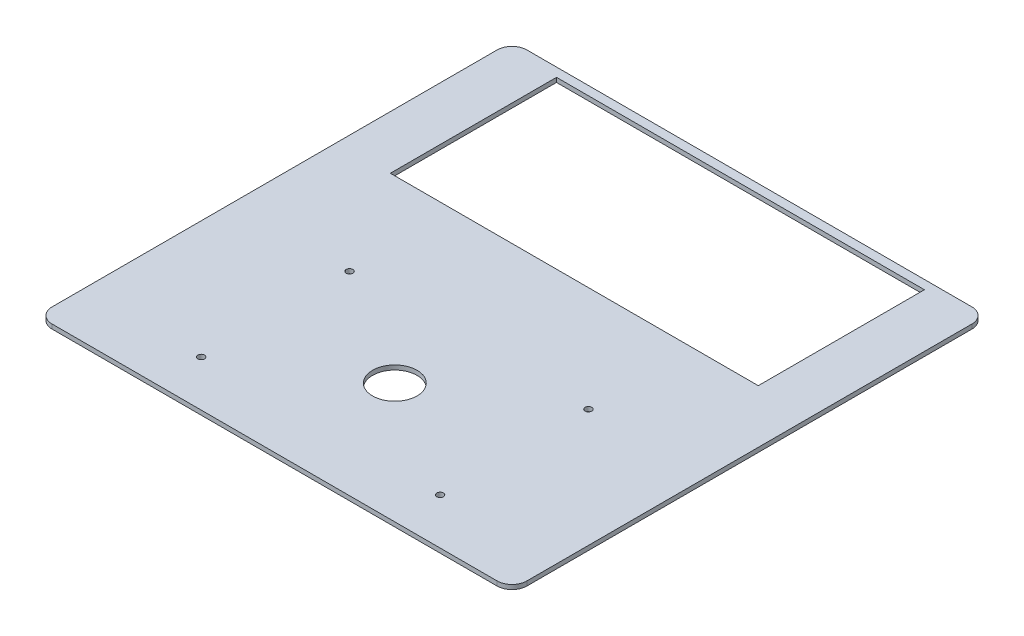
ISO-10303-21;
HEADER;
FILE_DESCRIPTION(('STEP AP214'),'2;1');
FILE_NAME('part.step','',(''),(''),'','','');
FILE_SCHEMA(('AUTOMOTIVE_DESIGN { 1 0 10303 214 1 1 1 1 }'));
ENDSEC;
DATA;
#1=APPLICATION_CONTEXT('core data for automotive mechanical design processes');
#2=APPLICATION_PROTOCOL_DEFINITION('international standard','automotive_design',2000,#1);
#3=PRODUCT_CONTEXT('',#1,'mechanical');
#4=PRODUCT('Part','Part','',(#3));
#5=PRODUCT_RELATED_PRODUCT_CATEGORY('part','',(#4));
#6=PRODUCT_DEFINITION_FORMATION('','',#4);
#7=PRODUCT_DEFINITION_CONTEXT('part definition',#1,'design');
#8=PRODUCT_DEFINITION('design','',#6,#7);
#9=PRODUCT_DEFINITION_SHAPE('','',#8);
#10=(LENGTH_UNIT() NAMED_UNIT(*) SI_UNIT(.MILLI.,.METRE.));
#11=(NAMED_UNIT(*) PLANE_ANGLE_UNIT() SI_UNIT($,.RADIAN.));
#12=(NAMED_UNIT(*) SI_UNIT($,.STERADIAN.) SOLID_ANGLE_UNIT());
#13=UNCERTAINTY_MEASURE_WITH_UNIT(LENGTH_MEASURE(1.E-05),#10,'distance_accuracy_value','');
#14=(GEOMETRIC_REPRESENTATION_CONTEXT(3) GLOBAL_UNCERTAINTY_ASSIGNED_CONTEXT((#13)) GLOBAL_UNIT_ASSIGNED_CONTEXT((#10,
#11,#12)) REPRESENTATION_CONTEXT('',''));
#15=CARTESIAN_POINT('',(0.,0.,0.));
#16=DIRECTION('',(0.,0.,1.));
#17=DIRECTION('',(1.,0.,0.));
#18=AXIS2_PLACEMENT_3D('',#15,#16,#17);
#19=CARTESIAN_POINT('',(169.2,3.,0.));
#20=DIRECTION('',(-1.,0.,0.));
#21=DIRECTION('',(0.,0.,1.));
#22=AXIS2_PLACEMENT_3D('',#19,#20,#21);
#23=PLANE('',#22);
#24=DIRECTION('',(0.,0.,-1.));
#25=VECTOR('',#24,1.);
#26=CARTESIAN_POINT('',(169.2,0.,0.));
#27=LINE('',#26,#25);
#28=CARTESIAN_POINT('',(169.2,0.,14.43));
#29=VERTEX_POINT('',#28);
#30=CARTESIAN_POINT('',(169.2,0.,-97.57));
#31=VERTEX_POINT('',#30);
#32=EDGE_CURVE('E129',#29,#31,#27,.T.);
#33=ORIENTED_EDGE('',*,*,#32,.F.);
#34=DIRECTION('',(0.,-1.,0.));
#35=VECTOR('',#34,1.);
#36=CARTESIAN_POINT('',(169.2,3.,14.43));
#37=LINE('',#36,#35);
#38=CARTESIAN_POINT('',(169.2,3.,14.43));
#39=VERTEX_POINT('',#38);
#40=EDGE_CURVE('E123',#39,#29,#37,.T.);
#41=ORIENTED_EDGE('',*,*,#40,.F.);
#42=DIRECTION('',(0.,0.,-1.));
#43=VECTOR('',#42,1.);
#44=CARTESIAN_POINT('',(169.2,3.,0.));
#45=LINE('',#44,#43);
#46=CARTESIAN_POINT('',(169.2,3.,-97.57));
#47=VERTEX_POINT('',#46);
#48=EDGE_CURVE('E126',#39,#47,#45,.T.);
#49=ORIENTED_EDGE('',*,*,#48,.T.);
#50=DIRECTION('',(0.,-1.,0.));
#51=VECTOR('',#50,1.);
#52=CARTESIAN_POINT('',(169.2,3.,-97.57));
#53=LINE('',#52,#51);
#54=EDGE_CURVE('E171',#47,#31,#53,.T.);
#55=ORIENTED_EDGE('',*,*,#54,.T.);
#56=EDGE_LOOP('',(#33,#41,#49,#55));
#57=FACE_BOUND('',#56,.T.);
#58=ADVANCED_FACE('F34',(#57),#23,.T.);
#59=CARTESIAN_POINT('',(0.,3.,14.43));
#60=DIRECTION('',(0.,0.,1.));
#61=DIRECTION('',(1.,0.,0.));
#62=AXIS2_PLACEMENT_3D('',#59,#60,#61);
#63=PLANE('',#62);
#64=DIRECTION('',(-1.,0.,0.));
#65=VECTOR('',#64,1.);
#66=CARTESIAN_POINT('',(0.,0.,14.43));
#67=LINE('',#66,#65);
#68=CARTESIAN_POINT('',(-78.8,0.,14.43));
#69=VERTEX_POINT('',#68);
#70=EDGE_CURVE('E184',#29,#69,#67,.T.);
#71=ORIENTED_EDGE('',*,*,#70,.T.);
#72=DIRECTION('',(0.,-1.,0.));
#73=VECTOR('',#72,1.);
#74=CARTESIAN_POINT('',(-78.8,3.,14.43));
#75=LINE('',#74,#73);
#76=CARTESIAN_POINT('',(-78.8,3.,14.43));
#77=VERTEX_POINT('',#76);
#78=EDGE_CURVE('E134',#77,#69,#75,.T.);
#79=ORIENTED_EDGE('',*,*,#78,.F.);
#80=DIRECTION('',(-1.,0.,0.));
#81=VECTOR('',#80,1.);
#82=CARTESIAN_POINT('',(0.,3.,14.43));
#83=LINE('',#82,#81);
#84=EDGE_CURVE('E138',#39,#77,#83,.T.);
#85=ORIENTED_EDGE('',*,*,#84,.F.);
#86=ORIENTED_EDGE('',*,*,#40,.T.);
#87=EDGE_LOOP('',(#71,#79,#85,#86));
#88=FACE_BOUND('',#87,.T.);
#89=ADVANCED_FACE('F139',(#88),#63,.F.);
#90=CARTESIAN_POINT('',(-78.8,3.,0.));
#91=DIRECTION('',(-1.,0.,0.));
#92=DIRECTION('',(0.,0.,1.));
#93=AXIS2_PLACEMENT_3D('',#90,#91,#92);
#94=PLANE('',#93);
#95=DIRECTION('',(0.,0.,-1.));
#96=VECTOR('',#95,1.);
#97=CARTESIAN_POINT('',(-78.8,0.,0.));
#98=LINE('',#97,#96);
#99=CARTESIAN_POINT('',(-78.8,0.,-97.57));
#100=VERTEX_POINT('',#99);
#101=EDGE_CURVE('E186',#69,#100,#98,.T.);
#102=ORIENTED_EDGE('',*,*,#101,.T.);
#103=DIRECTION('',(0.,-1.,0.));
#104=VECTOR('',#103,1.);
#105=CARTESIAN_POINT('',(-78.8,3.,-97.57));
#106=LINE('',#105,#104);
#107=CARTESIAN_POINT('',(-78.8,3.,-97.57));
#108=VERTEX_POINT('',#107);
#109=EDGE_CURVE('E209',#108,#100,#106,.T.);
#110=ORIENTED_EDGE('',*,*,#109,.F.);
#111=DIRECTION('',(0.,0.,-1.));
#112=VECTOR('',#111,1.);
#113=CARTESIAN_POINT('',(-78.8,3.,0.));
#114=LINE('',#113,#112);
#115=EDGE_CURVE('E142',#77,#108,#114,.T.);
#116=ORIENTED_EDGE('',*,*,#115,.F.);
#117=ORIENTED_EDGE('',*,*,#78,.T.);
#118=EDGE_LOOP('',(#102,#110,#116,#117));
#119=FACE_BOUND('',#118,.T.);
#120=ADVANCED_FACE('F292',(#119),#94,.F.);
#121=CARTESIAN_POINT('',(205.2,3.,0.));
#122=DIRECTION('',(1.,0.,0.));
#123=DIRECTION('',(0.,0.,-1.));
#124=AXIS2_PLACEMENT_3D('',#121,#122,#123);
#125=PLANE('',#124);
#126=DIRECTION('',(0.,0.,1.));
#127=VECTOR('',#126,1.);
#128=CARTESIAN_POINT('',(205.2,0.,0.));
#129=LINE('',#128,#127);
#130=CARTESIAN_POINT('',(205.2,0.,-93.57));
#131=VERTEX_POINT('',#130);
#132=CARTESIAN_POINT('',(205.2,0.,206.43));
#133=VERTEX_POINT('',#132);
#134=EDGE_CURVE('E172',#131,#133,#129,.T.);
#135=ORIENTED_EDGE('',*,*,#134,.F.);
#136=DIRECTION('',(0.,-1.,0.));
#137=VECTOR('',#136,1.);
#138=CARTESIAN_POINT('',(205.2,3.,-93.57));
#139=LINE('',#138,#137);
#140=CARTESIAN_POINT('',(205.2,3.,-93.57));
#141=VERTEX_POINT('',#140);
#142=EDGE_CURVE('E227',#131,#141,#139,.F.);
#143=ORIENTED_EDGE('',*,*,#142,.T.);
#144=DIRECTION('',(0.,0.,1.));
#145=VECTOR('',#144,1.);
#146=CARTESIAN_POINT('',(205.2,3.,0.));
#147=LINE('',#146,#145);
#148=CARTESIAN_POINT('',(205.2,3.,206.43));
#149=VERTEX_POINT('',#148);
#150=EDGE_CURVE('E207',#141,#149,#147,.T.);
#151=ORIENTED_EDGE('',*,*,#150,.T.);
#152=DIRECTION('',(0.,-1.,0.));
#153=VECTOR('',#152,1.);
#154=CARTESIAN_POINT('',(205.2,0.,206.43));
#155=LINE('',#154,#153);
#156=EDGE_CURVE('E224',#149,#133,#155,.T.);
#157=ORIENTED_EDGE('',*,*,#156,.T.);
#158=EDGE_LOOP('',(#135,#143,#151,#157));
#159=FACE_BOUND('',#158,.T.);
#160=ADVANCED_FACE('F256',(#159),#125,.T.);
#161=CARTESIAN_POINT('',(0.,3.,-103.57));
#162=DIRECTION('',(0.,0.,-1.));
#163=DIRECTION('',(-1.,0.,0.));
#164=AXIS2_PLACEMENT_3D('',#161,#162,#163);
#165=PLANE('',#164);
#166=DIRECTION('',(1.,0.,0.));
#167=VECTOR('',#166,1.);
#168=CARTESIAN_POINT('',(0.,3.,-103.57));
#169=LINE('',#168,#167);
#170=CARTESIAN_POINT('',(-104.8,3.,-103.57));
#171=VERTEX_POINT('',#170);
#172=CARTESIAN_POINT('',(195.2,3.,-103.57));
#173=VERTEX_POINT('',#172);
#174=EDGE_CURVE('E260',#171,#173,#169,.T.);
#175=ORIENTED_EDGE('',*,*,#174,.T.);
#176=DIRECTION('',(0.,-1.,0.));
#177=VECTOR('',#176,1.);
#178=CARTESIAN_POINT('',(195.2,3.,-103.57));
#179=LINE('',#178,#177);
#180=CARTESIAN_POINT('',(195.2,0.,-103.57));
#181=VERTEX_POINT('',#180);
#182=EDGE_CURVE('E213',#173,#181,#179,.T.);
#183=ORIENTED_EDGE('',*,*,#182,.T.);
#184=DIRECTION('',(1.,0.,0.));
#185=VECTOR('',#184,1.);
#186=CARTESIAN_POINT('',(0.,0.,-103.57));
#187=LINE('',#186,#185);
#188=CARTESIAN_POINT('',(-104.8,0.,-103.57));
#189=VERTEX_POINT('',#188);
#190=EDGE_CURVE('E175',#189,#181,#187,.T.);
#191=ORIENTED_EDGE('',*,*,#190,.F.);
#192=DIRECTION('',(0.,-1.,0.));
#193=VECTOR('',#192,1.);
#194=CARTESIAN_POINT('',(-104.8,3.,-103.57));
#195=LINE('',#194,#193);
#196=EDGE_CURVE('E133',#189,#171,#195,.F.);
#197=ORIENTED_EDGE('',*,*,#196,.T.);
#198=EDGE_LOOP('',(#175,#183,#191,#197));
#199=FACE_BOUND('',#198,.T.);
#200=ADVANCED_FACE('F275',(#199),#165,.T.);
#201=CARTESIAN_POINT('',(-114.8,3.,0.));
#202=DIRECTION('',(1.,0.,0.));
#203=DIRECTION('',(0.,0.,-1.));
#204=AXIS2_PLACEMENT_3D('',#201,#202,#203);
#205=PLANE('',#204);
#206=DIRECTION('',(0.,0.,1.));
#207=VECTOR('',#206,1.);
#208=CARTESIAN_POINT('',(-114.8,3.,0.));
#209=LINE('',#208,#207);
#210=CARTESIAN_POINT('',(-114.8,3.,-93.57));
#211=VERTEX_POINT('',#210);
#212=CARTESIAN_POINT('',(-114.8,3.,206.43));
#213=VERTEX_POINT('',#212);
#214=EDGE_CURVE('E150',#211,#213,#209,.T.);
#215=ORIENTED_EDGE('',*,*,#214,.F.);
#216=DIRECTION('',(0.,-1.,0.));
#217=VECTOR('',#216,1.);
#218=CARTESIAN_POINT('',(-114.8,0.,-93.57));
#219=LINE('',#218,#217);
#220=CARTESIAN_POINT('',(-114.8,0.,-93.57));
#221=VERTEX_POINT('',#220);
#222=EDGE_CURVE('E238',#211,#221,#219,.T.);
#223=ORIENTED_EDGE('',*,*,#222,.T.);
#224=DIRECTION('',(0.,0.,1.));
#225=VECTOR('',#224,1.);
#226=CARTESIAN_POINT('',(-114.8,0.,0.));
#227=LINE('',#226,#225);
#228=CARTESIAN_POINT('',(-114.8,0.,206.43));
#229=VERTEX_POINT('',#228);
#230=EDGE_CURVE('E178',#221,#229,#227,.T.);
#231=ORIENTED_EDGE('',*,*,#230,.T.);
#232=DIRECTION('',(0.,-1.,0.));
#233=VECTOR('',#232,1.);
#234=CARTESIAN_POINT('',(-114.8,3.,206.43));
#235=LINE('',#234,#233);
#236=EDGE_CURVE('E236',#229,#213,#235,.F.);
#237=ORIENTED_EDGE('',*,*,#236,.T.);
#238=EDGE_LOOP('',(#215,#223,#231,#237));
#239=FACE_BOUND('',#238,.T.);
#240=ADVANCED_FACE('F270',(#239),#205,.F.);
#241=CARTESIAN_POINT('',(125.7,3.,85.43));
#242=DIRECTION('',(0.,-1.,0.));
#243=DIRECTION('',(0.,0.,-1.));
#244=AXIS2_PLACEMENT_3D('',#241,#242,#243);
#245=CYLINDRICAL_SURFACE('',#244,2.25000000000001);
#246=CARTESIAN_POINT('',(125.7,3.,85.43));
#247=DIRECTION('',(0.,1.,0.));
#248=DIRECTION('',(0.,0.,1.));
#249=AXIS2_PLACEMENT_3D('',#246,#247,#248);
#250=CIRCLE('',#249,2.25000000000001);
#251=CARTESIAN_POINT('',(125.7,3.,87.68));
#252=VERTEX_POINT('',#251);
#253=EDGE_CURVE('E165',#252,#252,#250,.T.);
#254=ORIENTED_EDGE('',*,*,#253,.T.);
#255=EDGE_LOOP('',(#254));
#256=FACE_BOUND('',#255,.T.);
#257=CARTESIAN_POINT('',(125.7,0.,85.43));
#258=DIRECTION('',(0.,1.,0.));
#259=DIRECTION('',(0.,0.,1.));
#260=AXIS2_PLACEMENT_3D('',#257,#258,#259);
#261=CIRCLE('',#260,2.25000000000001);
#262=CARTESIAN_POINT('',(125.7,0.,87.68));
#263=VERTEX_POINT('',#262);
#264=EDGE_CURVE('E201',#263,#263,#261,.T.);
#265=ORIENTED_EDGE('',*,*,#264,.F.);
#266=EDGE_LOOP('',(#265));
#267=FACE_BOUND('',#266,.T.);
#268=ADVANCED_FACE('F302',(#256,#267),#245,.F.);
#269=CARTESIAN_POINT('',(125.7,3.,185.43));
#270=DIRECTION('',(0.,-1.,0.));
#271=DIRECTION('',(0.,0.,-1.));
#272=AXIS2_PLACEMENT_3D('',#269,#270,#271);
#273=CYLINDRICAL_SURFACE('',#272,2.25000000000001);
#274=CARTESIAN_POINT('',(125.7,3.,185.43));
#275=DIRECTION('',(0.,1.,0.));
#276=DIRECTION('',(0.,0.,1.));
#277=AXIS2_PLACEMENT_3D('',#274,#275,#276);
#278=CIRCLE('',#277,2.25000000000001);
#279=CARTESIAN_POINT('',(125.7,3.,187.68));
#280=VERTEX_POINT('',#279);
#281=EDGE_CURVE('E162',#280,#280,#278,.T.);
#282=ORIENTED_EDGE('',*,*,#281,.T.);
#283=EDGE_LOOP('',(#282));
#284=FACE_BOUND('',#283,.T.);
#285=CARTESIAN_POINT('',(125.7,0.,185.43));
#286=DIRECTION('',(0.,1.,0.));
#287=DIRECTION('',(0.,0.,1.));
#288=AXIS2_PLACEMENT_3D('',#285,#286,#287);
#289=CIRCLE('',#288,2.25000000000001);
#290=CARTESIAN_POINT('',(125.7,0.,187.68));
#291=VERTEX_POINT('',#290);
#292=EDGE_CURVE('E198',#291,#291,#289,.T.);
#293=ORIENTED_EDGE('',*,*,#292,.F.);
#294=EDGE_LOOP('',(#293));
#295=FACE_BOUND('',#294,.T.);
#296=ADVANCED_FACE('F323',(#284,#295),#273,.F.);
#297=CARTESIAN_POINT('',(-35.2999999999999,3.,185.43));
#298=DIRECTION('',(0.,-1.,0.));
#299=DIRECTION('',(0.,0.,-1.));
#300=AXIS2_PLACEMENT_3D('',#297,#298,#299);
#301=CYLINDRICAL_SURFACE('',#300,2.25);
#302=CARTESIAN_POINT('',(-35.2999999999999,3.,185.43));
#303=DIRECTION('',(0.,1.,0.));
#304=DIRECTION('',(0.,0.,1.));
#305=AXIS2_PLACEMENT_3D('',#302,#303,#304);
#306=CIRCLE('',#305,2.25);
#307=CARTESIAN_POINT('',(-35.2999999999999,3.,187.68));
#308=VERTEX_POINT('',#307);
#309=EDGE_CURVE('E159',#308,#308,#306,.T.);
#310=ORIENTED_EDGE('',*,*,#309,.T.);
#311=EDGE_LOOP('',(#310));
#312=FACE_BOUND('',#311,.T.);
#313=CARTESIAN_POINT('',(-35.2999999999999,0.,185.43));
#314=DIRECTION('',(0.,1.,0.));
#315=DIRECTION('',(0.,0.,1.));
#316=AXIS2_PLACEMENT_3D('',#313,#314,#315);
#317=CIRCLE('',#316,2.25);
#318=CARTESIAN_POINT('',(-35.2999999999999,0.,187.68));
#319=VERTEX_POINT('',#318);
#320=EDGE_CURVE('E195',#319,#319,#317,.T.);
#321=ORIENTED_EDGE('',*,*,#320,.F.);
#322=EDGE_LOOP('',(#321));
#323=FACE_BOUND('',#322,.T.);
#324=ADVANCED_FACE('F319',(#312,#323),#301,.F.);
#325=CARTESIAN_POINT('',(45.2,3.,135.43));
#326=DIRECTION('',(0.,-1.,0.));
#327=DIRECTION('',(0.,0.,-1.));
#328=AXIS2_PLACEMENT_3D('',#325,#326,#327);
#329=CYLINDRICAL_SURFACE('',#328,15.);
#330=CARTESIAN_POINT('',(45.2,3.,135.43));
#331=DIRECTION('',(0.,1.,0.));
#332=DIRECTION('',(0.,0.,1.));
#333=AXIS2_PLACEMENT_3D('',#330,#331,#332);
#334=CIRCLE('',#333,15.);
#335=CARTESIAN_POINT('',(45.2,3.,150.43));
#336=VERTEX_POINT('',#335);
#337=EDGE_CURVE('E156',#336,#336,#334,.T.);
#338=ORIENTED_EDGE('',*,*,#337,.T.);
#339=EDGE_LOOP('',(#338));
#340=FACE_BOUND('',#339,.T.);
#341=CARTESIAN_POINT('',(45.2,0.,135.43));
#342=DIRECTION('',(0.,1.,0.));
#343=DIRECTION('',(0.,0.,1.));
#344=AXIS2_PLACEMENT_3D('',#341,#342,#343);
#345=CIRCLE('',#344,15.);
#346=CARTESIAN_POINT('',(45.2,0.,150.43));
#347=VERTEX_POINT('',#346);
#348=EDGE_CURVE('E192',#347,#347,#345,.T.);
#349=ORIENTED_EDGE('',*,*,#348,.F.);
#350=EDGE_LOOP('',(#349));
#351=FACE_BOUND('',#350,.T.);
#352=ADVANCED_FACE('F315',(#340,#351),#329,.F.);
#353=CARTESIAN_POINT('',(0.,3.,-97.57));
#354=DIRECTION('',(0.,0.,1.));
#355=DIRECTION('',(1.,0.,0.));
#356=AXIS2_PLACEMENT_3D('',#353,#354,#355);
#357=PLANE('',#356);
#358=DIRECTION('',(-1.,0.,0.));
#359=VECTOR('',#358,1.);
#360=CARTESIAN_POINT('',(0.,0.,-97.57));
#361=LINE('',#360,#359);
#362=EDGE_CURVE('E189',#31,#100,#361,.T.);
#363=ORIENTED_EDGE('',*,*,#362,.F.);
#364=ORIENTED_EDGE('',*,*,#54,.F.);
#365=DIRECTION('',(-1.,0.,0.));
#366=VECTOR('',#365,1.);
#367=CARTESIAN_POINT('',(0.,3.,-97.57));
#368=LINE('',#367,#366);
#369=EDGE_CURVE('E147',#47,#108,#368,.T.);
#370=ORIENTED_EDGE('',*,*,#369,.T.);
#371=ORIENTED_EDGE('',*,*,#109,.T.);
#372=EDGE_LOOP('',(#363,#364,#370,#371));
#373=FACE_BOUND('',#372,.T.);
#374=ADVANCED_FACE('F299',(#373),#357,.T.);
#375=CARTESIAN_POINT('',(0.,3.,216.43));
#376=DIRECTION('',(0.,0.,-1.));
#377=DIRECTION('',(-1.,0.,0.));
#378=AXIS2_PLACEMENT_3D('',#375,#376,#377);
#379=PLANE('',#378);
#380=DIRECTION('',(1.,0.,0.));
#381=VECTOR('',#380,1.);
#382=CARTESIAN_POINT('',(0.,0.,216.43));
#383=LINE('',#382,#381);
#384=CARTESIAN_POINT('',(-104.8,0.,216.43));
#385=VERTEX_POINT('',#384);
#386=CARTESIAN_POINT('',(195.2,0.,216.43));
#387=VERTEX_POINT('',#386);
#388=EDGE_CURVE('E181',#385,#387,#383,.T.);
#389=ORIENTED_EDGE('',*,*,#388,.T.);
#390=DIRECTION('',(0.,-1.,0.));
#391=VECTOR('',#390,1.);
#392=CARTESIAN_POINT('',(195.2,3.,216.43));
#393=LINE('',#392,#391);
#394=CARTESIAN_POINT('',(195.2,3.,216.43));
#395=VERTEX_POINT('',#394);
#396=EDGE_CURVE('E11',#387,#395,#393,.F.);
#397=ORIENTED_EDGE('',*,*,#396,.T.);
#398=DIRECTION('',(1.,0.,0.));
#399=VECTOR('',#398,1.);
#400=CARTESIAN_POINT('',(0.,3.,216.43));
#401=LINE('',#400,#399);
#402=CARTESIAN_POINT('',(-104.8,3.,216.43));
#403=VERTEX_POINT('',#402);
#404=EDGE_CURVE('E148',#403,#395,#401,.T.);
#405=ORIENTED_EDGE('',*,*,#404,.F.);
#406=DIRECTION('',(0.,-1.,0.));
#407=VECTOR('',#406,1.);
#408=CARTESIAN_POINT('',(-104.8,3.,216.43));
#409=LINE('',#408,#407);
#410=EDGE_CURVE('E42',#403,#385,#409,.T.);
#411=ORIENTED_EDGE('',*,*,#410,.T.);
#412=EDGE_LOOP('',(#389,#397,#405,#411));
#413=FACE_BOUND('',#412,.T.);
#414=ADVANCED_FACE('F243',(#413),#379,.F.);
#415=CARTESIAN_POINT('',(-35.3,3.,85.43));
#416=DIRECTION('',(0.,-1.,0.));
#417=DIRECTION('',(0.,0.,-1.));
#418=AXIS2_PLACEMENT_3D('',#415,#416,#417);
#419=CYLINDRICAL_SURFACE('',#418,2.25);
#420=CARTESIAN_POINT('',(-35.3,3.,85.43));
#421=DIRECTION('',(0.,1.,0.));
#422=DIRECTION('',(0.,0.,1.));
#423=AXIS2_PLACEMENT_3D('',#420,#421,#422);
#424=CIRCLE('',#423,2.25);
#425=CARTESIAN_POINT('',(-35.3,3.,87.68));
#426=VERTEX_POINT('',#425);
#427=EDGE_CURVE('E168',#426,#426,#424,.T.);
#428=ORIENTED_EDGE('',*,*,#427,.T.);
#429=EDGE_LOOP('',(#428));
#430=FACE_BOUND('',#429,.T.);
#431=CARTESIAN_POINT('',(-35.3,0.,85.43));
#432=DIRECTION('',(0.,1.,0.));
#433=DIRECTION('',(0.,0.,1.));
#434=AXIS2_PLACEMENT_3D('',#431,#432,#433);
#435=CIRCLE('',#434,2.25);
#436=CARTESIAN_POINT('',(-35.3,0.,87.68));
#437=VERTEX_POINT('',#436);
#438=EDGE_CURVE('E204',#437,#437,#435,.T.);
#439=ORIENTED_EDGE('',*,*,#438,.F.);
#440=EDGE_LOOP('',(#439));
#441=FACE_BOUND('',#440,.T.);
#442=ADVANCED_FACE('F298',(#430,#441),#419,.F.);
#443=CARTESIAN_POINT('',(0.,3.,0.));
#444=DIRECTION('',(0.,1.,0.));
#445=DIRECTION('',(0.,0.,1.));
#446=AXIS2_PLACEMENT_3D('',#443,#444,#445);
#447=PLANE('',#446);
#448=ORIENTED_EDGE('',*,*,#150,.F.);
#449=CARTESIAN_POINT('',(195.2,3.,-93.57));
#450=DIRECTION('',(0.,1.,0.));
#451=DIRECTION('',(0.,0.,1.));
#452=AXIS2_PLACEMENT_3D('',#449,#450,#451);
#453=CIRCLE('',#452,10.);
#454=EDGE_CURVE('E234',#141,#173,#453,.T.);
#455=ORIENTED_EDGE('',*,*,#454,.T.);
#456=ORIENTED_EDGE('',*,*,#174,.F.);
#457=CARTESIAN_POINT('',(-104.8,3.,-93.57));
#458=DIRECTION('',(0.,1.,0.));
#459=DIRECTION('',(0.,0.,1.));
#460=AXIS2_PLACEMENT_3D('',#457,#458,#459);
#461=CIRCLE('',#460,10.);
#462=EDGE_CURVE('E232',#171,#211,#461,.T.);
#463=ORIENTED_EDGE('',*,*,#462,.T.);
#464=ORIENTED_EDGE('',*,*,#214,.T.);
#465=CARTESIAN_POINT('',(-104.8,3.,206.43));
#466=DIRECTION('',(0.,1.,0.));
#467=DIRECTION('',(0.,0.,1.));
#468=AXIS2_PLACEMENT_3D('',#465,#466,#467);
#469=CIRCLE('',#468,10.);
#470=EDGE_CURVE('E54',#213,#403,#469,.T.);
#471=ORIENTED_EDGE('',*,*,#470,.T.);
#472=ORIENTED_EDGE('',*,*,#404,.T.);
#473=CARTESIAN_POINT('',(195.2,3.,206.43));
#474=DIRECTION('',(0.,1.,0.));
#475=DIRECTION('',(0.,0.,1.));
#476=AXIS2_PLACEMENT_3D('',#473,#474,#475);
#477=CIRCLE('',#476,10.);
#478=EDGE_CURVE('E230',#395,#149,#477,.T.);
#479=ORIENTED_EDGE('',*,*,#478,.T.);
#480=EDGE_LOOP('',(#448,#455,#456,#463,#464,#471,#472,#479));
#481=FACE_BOUND('',#480,.T.);
#482=ORIENTED_EDGE('',*,*,#48,.F.);
#483=ORIENTED_EDGE('',*,*,#84,.T.);
#484=ORIENTED_EDGE('',*,*,#115,.T.);
#485=ORIENTED_EDGE('',*,*,#369,.F.);
#486=EDGE_LOOP('',(#482,#483,#484,#485));
#487=FACE_BOUND('',#486,.T.);
#488=ORIENTED_EDGE('',*,*,#337,.F.);
#489=EDGE_LOOP('',(#488));
#490=FACE_BOUND('',#489,.T.);
#491=ORIENTED_EDGE('',*,*,#309,.F.);
#492=EDGE_LOOP('',(#491));
#493=FACE_BOUND('',#492,.T.);
#494=ORIENTED_EDGE('',*,*,#281,.F.);
#495=EDGE_LOOP('',(#494));
#496=FACE_BOUND('',#495,.T.);
#497=ORIENTED_EDGE('',*,*,#253,.F.);
#498=EDGE_LOOP('',(#497));
#499=FACE_BOUND('',#498,.T.);
#500=ORIENTED_EDGE('',*,*,#427,.F.);
#501=EDGE_LOOP('',(#500));
#502=FACE_BOUND('',#501,.T.);
#503=ADVANCED_FACE('F144',(#481,#487,#490,#493,#496,#499,#502),#447,.T.);
#504=CARTESIAN_POINT('',(0.,0.,0.));
#505=DIRECTION('',(0.,1.,0.));
#506=DIRECTION('',(0.,0.,1.));
#507=AXIS2_PLACEMENT_3D('',#504,#505,#506);
#508=PLANE('',#507);
#509=ORIENTED_EDGE('',*,*,#190,.T.);
#510=CARTESIAN_POINT('',(195.2,0.,-93.57));
#511=DIRECTION('',(0.,1.,0.));
#512=DIRECTION('',(0.,0.,1.));
#513=AXIS2_PLACEMENT_3D('',#510,#511,#512);
#514=CIRCLE('',#513,10.);
#515=EDGE_CURVE('E222',#181,#131,#514,.F.);
#516=ORIENTED_EDGE('',*,*,#515,.T.);
#517=ORIENTED_EDGE('',*,*,#134,.T.);
#518=CARTESIAN_POINT('',(195.2,0.,206.43));
#519=DIRECTION('',(0.,1.,0.));
#520=DIRECTION('',(0.,0.,1.));
#521=AXIS2_PLACEMENT_3D('',#518,#519,#520);
#522=CIRCLE('',#521,10.);
#523=EDGE_CURVE('E218',#133,#387,#522,.F.);
#524=ORIENTED_EDGE('',*,*,#523,.T.);
#525=ORIENTED_EDGE('',*,*,#388,.F.);
#526=CARTESIAN_POINT('',(-104.8,0.,206.43));
#527=DIRECTION('',(0.,1.,0.));
#528=DIRECTION('',(0.,0.,1.));
#529=AXIS2_PLACEMENT_3D('',#526,#527,#528);
#530=CIRCLE('',#529,10.);
#531=EDGE_CURVE('E216',#385,#229,#530,.F.);
#532=ORIENTED_EDGE('',*,*,#531,.T.);
#533=ORIENTED_EDGE('',*,*,#230,.F.);
#534=CARTESIAN_POINT('',(-104.8,0.,-93.57));
#535=DIRECTION('',(0.,1.,0.));
#536=DIRECTION('',(0.,0.,1.));
#537=AXIS2_PLACEMENT_3D('',#534,#535,#536);
#538=CIRCLE('',#537,10.);
#539=EDGE_CURVE('E220',#221,#189,#538,.F.);
#540=ORIENTED_EDGE('',*,*,#539,.T.);
#541=EDGE_LOOP('',(#509,#516,#517,#524,#525,#532,#533,#540));
#542=FACE_BOUND('',#541,.T.);
#543=ORIENTED_EDGE('',*,*,#32,.T.);
#544=ORIENTED_EDGE('',*,*,#362,.T.);
#545=ORIENTED_EDGE('',*,*,#101,.F.);
#546=ORIENTED_EDGE('',*,*,#70,.F.);
#547=EDGE_LOOP('',(#543,#544,#545,#546));
#548=FACE_BOUND('',#547,.T.);
#549=ORIENTED_EDGE('',*,*,#348,.T.);
#550=EDGE_LOOP('',(#549));
#551=FACE_BOUND('',#550,.T.);
#552=ORIENTED_EDGE('',*,*,#320,.T.);
#553=EDGE_LOOP('',(#552));
#554=FACE_BOUND('',#553,.T.);
#555=ORIENTED_EDGE('',*,*,#292,.T.);
#556=EDGE_LOOP('',(#555));
#557=FACE_BOUND('',#556,.T.);
#558=ORIENTED_EDGE('',*,*,#264,.T.);
#559=EDGE_LOOP('',(#558));
#560=FACE_BOUND('',#559,.T.);
#561=ORIENTED_EDGE('',*,*,#438,.T.);
#562=EDGE_LOOP('',(#561));
#563=FACE_BOUND('',#562,.T.);
#564=ADVANCED_FACE('F246',(#542,#548,#551,#554,#557,#560,#563),#508,.F.);
#565=CARTESIAN_POINT('',(195.2,3.,-93.57));
#566=DIRECTION('',(0.,-1.,0.));
#567=DIRECTION('',(0.,0.,-1.));
#568=AXIS2_PLACEMENT_3D('',#565,#566,#567);
#569=CYLINDRICAL_SURFACE('',#568,10.);
#570=ORIENTED_EDGE('',*,*,#454,.F.);
#571=ORIENTED_EDGE('',*,*,#142,.F.);
#572=ORIENTED_EDGE('',*,*,#515,.F.);
#573=ORIENTED_EDGE('',*,*,#182,.F.);
#574=EDGE_LOOP('',(#570,#571,#572,#573));
#575=FACE_BOUND('',#574,.T.);
#576=ADVANCED_FACE('F279',(#575),#569,.T.);
#577=CARTESIAN_POINT('',(-104.8,3.,-93.57));
#578=DIRECTION('',(0.,1.,0.));
#579=DIRECTION('',(0.,0.,1.));
#580=AXIS2_PLACEMENT_3D('',#577,#578,#579);
#581=CYLINDRICAL_SURFACE('',#580,10.);
#582=ORIENTED_EDGE('',*,*,#462,.F.);
#583=ORIENTED_EDGE('',*,*,#196,.F.);
#584=ORIENTED_EDGE('',*,*,#539,.F.);
#585=ORIENTED_EDGE('',*,*,#222,.F.);
#586=EDGE_LOOP('',(#582,#583,#584,#585));
#587=FACE_BOUND('',#586,.T.);
#588=ADVANCED_FACE('F277',(#587),#581,.T.);
#589=CARTESIAN_POINT('',(195.2,3.,206.43));
#590=DIRECTION('',(0.,1.,0.));
#591=DIRECTION('',(0.,0.,1.));
#592=AXIS2_PLACEMENT_3D('',#589,#590,#591);
#593=CYLINDRICAL_SURFACE('',#592,10.);
#594=ORIENTED_EDGE('',*,*,#478,.F.);
#595=ORIENTED_EDGE('',*,*,#396,.F.);
#596=ORIENTED_EDGE('',*,*,#523,.F.);
#597=ORIENTED_EDGE('',*,*,#156,.F.);
#598=EDGE_LOOP('',(#594,#595,#596,#597));
#599=FACE_BOUND('',#598,.T.);
#600=ADVANCED_FACE('F253',(#599),#593,.T.);
#601=CARTESIAN_POINT('',(-104.8,3.,206.43));
#602=DIRECTION('',(0.,-1.,0.));
#603=DIRECTION('',(0.,0.,-1.));
#604=AXIS2_PLACEMENT_3D('',#601,#602,#603);
#605=CYLINDRICAL_SURFACE('',#604,10.);
#606=ORIENTED_EDGE('',*,*,#470,.F.);
#607=ORIENTED_EDGE('',*,*,#236,.F.);
#608=ORIENTED_EDGE('',*,*,#531,.F.);
#609=ORIENTED_EDGE('',*,*,#410,.F.);
#610=EDGE_LOOP('',(#606,#607,#608,#609));
#611=FACE_BOUND('',#610,.T.);
#612=ADVANCED_FACE('F36',(#611),#605,.T.);
#613=CLOSED_SHELL('',(#58,#89,#120,#160,#200,#240,#268,#296,#324,#352,#374,#414,#442,#503,#564,
#576,#588,#600,#612));
#614=MANIFOLD_SOLID_BREP('B2',#613);
#615=ADVANCED_BREP_SHAPE_REPRESENTATION('',(#18,#614),#14);
#616=SHAPE_DEFINITION_REPRESENTATION(#9,#615);
ENDSEC;
END-ISO-10303-21;
